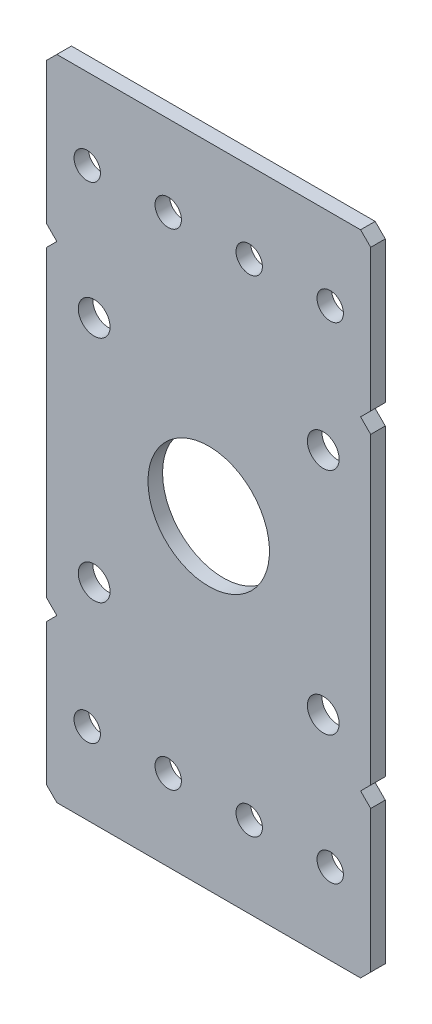
ISO-10303-21;
HEADER;
FILE_DESCRIPTION(('STEP AP214'),'2;1');
FILE_NAME('part.step','',(''),(''),'','','');
FILE_SCHEMA(('AUTOMOTIVE_DESIGN { 1 0 10303 214 1 1 1 1 }'));
ENDSEC;
DATA;
#1=APPLICATION_CONTEXT('core data for automotive mechanical design processes');
#2=APPLICATION_PROTOCOL_DEFINITION('international standard','automotive_design',2000,#1);
#3=PRODUCT_CONTEXT('',#1,'mechanical');
#4=PRODUCT('Part','Part','',(#3));
#5=PRODUCT_RELATED_PRODUCT_CATEGORY('part','',(#4));
#6=PRODUCT_DEFINITION_FORMATION('','',#4);
#7=PRODUCT_DEFINITION_CONTEXT('part definition',#1,'design');
#8=PRODUCT_DEFINITION('design','',#6,#7);
#9=PRODUCT_DEFINITION_SHAPE('','',#8);
#10=(LENGTH_UNIT() NAMED_UNIT(*) SI_UNIT(.MILLI.,.METRE.));
#11=(NAMED_UNIT(*) PLANE_ANGLE_UNIT() SI_UNIT($,.RADIAN.));
#12=(NAMED_UNIT(*) SI_UNIT($,.STERADIAN.) SOLID_ANGLE_UNIT());
#13=UNCERTAINTY_MEASURE_WITH_UNIT(LENGTH_MEASURE(1.E-05),#10,'distance_accuracy_value','');
#14=(GEOMETRIC_REPRESENTATION_CONTEXT(3) GLOBAL_UNCERTAINTY_ASSIGNED_CONTEXT((#13)) GLOBAL_UNIT_ASSIGNED_CONTEXT((#10,
#11,#12)) REPRESENTATION_CONTEXT('',''));
#15=CARTESIAN_POINT('',(0.,0.,0.));
#16=DIRECTION('',(0.,0.,1.));
#17=DIRECTION('',(1.,0.,0.));
#18=AXIS2_PLACEMENT_3D('',#15,#16,#17);
#19=CARTESIAN_POINT('',(25.4,50.8,2.286));
#20=DIRECTION('',(0.,0.,-1.));
#21=DIRECTION('',(-1.,0.,0.));
#22=AXIS2_PLACEMENT_3D('',#19,#20,#21);
#23=PLANE('',#22);
#24=CARTESIAN_POINT('',(-17.9605122421383,-17.9605122421383,2.286));
#25=DIRECTION('',(0.,0.,-1.));
#26=DIRECTION('',(-1.,0.,0.));
#27=AXIS2_PLACEMENT_3D('',#24,#25,#26);
#28=CIRCLE('',#27,2.4892);
#29=CARTESIAN_POINT('',(-20.4497122421383,-17.9605122421383,2.286));
#30=VERTEX_POINT('',#29);
#31=EDGE_CURVE('E213',#30,#30,#28,.T.);
#32=ORIENTED_EDGE('',*,*,#31,.T.);
#33=EDGE_LOOP('',(#32));
#34=FACE_BOUND('',#33,.T.);
#35=CARTESIAN_POINT('',(-19.05,-38.1,2.286));
#36=DIRECTION('',(0.,0.,-1.));
#37=DIRECTION('',(-1.,0.,0.));
#38=AXIS2_PLACEMENT_3D('',#35,#36,#37);
#39=CIRCLE('',#38,2.0701);
#40=CARTESIAN_POINT('',(-21.1201,-38.1,2.286));
#41=VERTEX_POINT('',#40);
#42=EDGE_CURVE('E217',#41,#41,#39,.T.);
#43=ORIENTED_EDGE('',*,*,#42,.T.);
#44=EDGE_LOOP('',(#43));
#45=FACE_BOUND('',#44,.T.);
#46=CARTESIAN_POINT('',(-6.35000000000001,-38.1,2.286));
#47=DIRECTION('',(0.,0.,-1.));
#48=DIRECTION('',(-1.,0.,0.));
#49=AXIS2_PLACEMENT_3D('',#46,#47,#48);
#50=CIRCLE('',#49,2.07009999999999);
#51=CARTESIAN_POINT('',(-8.4201,-38.1,2.286));
#52=VERTEX_POINT('',#51);
#53=EDGE_CURVE('E220',#52,#52,#50,.T.);
#54=ORIENTED_EDGE('',*,*,#53,.T.);
#55=EDGE_LOOP('',(#54));
#56=FACE_BOUND('',#55,.T.);
#57=CARTESIAN_POINT('',(19.05,-38.1,2.286));
#58=DIRECTION('',(0.,0.,-1.));
#59=DIRECTION('',(-1.,0.,0.));
#60=AXIS2_PLACEMENT_3D('',#57,#58,#59);
#61=CIRCLE('',#60,2.07009999999999);
#62=CARTESIAN_POINT('',(16.9799,-38.1,2.286));
#63=VERTEX_POINT('',#62);
#64=EDGE_CURVE('E223',#63,#63,#61,.T.);
#65=ORIENTED_EDGE('',*,*,#64,.T.);
#66=EDGE_LOOP('',(#65));
#67=FACE_BOUND('',#66,.T.);
#68=CARTESIAN_POINT('',(0.,0.,2.286));
#69=DIRECTION('',(0.,0.,-1.));
#70=DIRECTION('',(-1.,0.,0.));
#71=AXIS2_PLACEMENT_3D('',#68,#69,#70);
#72=CIRCLE('',#71,9.525);
#73=CARTESIAN_POINT('',(-9.525,0.,2.286));
#74=VERTEX_POINT('',#73);
#75=EDGE_CURVE('E226',#74,#74,#72,.T.);
#76=ORIENTED_EDGE('',*,*,#75,.T.);
#77=EDGE_LOOP('',(#76));
#78=FACE_BOUND('',#77,.T.);
#79=CARTESIAN_POINT('',(6.34999999999999,38.1,2.286));
#80=DIRECTION('',(0.,0.,-1.));
#81=DIRECTION('',(-1.,0.,0.));
#82=AXIS2_PLACEMENT_3D('',#79,#80,#81);
#83=CIRCLE('',#82,2.07009999999999);
#84=CARTESIAN_POINT('',(4.2799,38.1,2.286));
#85=VERTEX_POINT('',#84);
#86=EDGE_CURVE('E229',#85,#85,#83,.T.);
#87=ORIENTED_EDGE('',*,*,#86,.T.);
#88=EDGE_LOOP('',(#87));
#89=FACE_BOUND('',#88,.T.);
#90=CARTESIAN_POINT('',(-19.05,38.1,2.286));
#91=DIRECTION('',(0.,0.,-1.));
#92=DIRECTION('',(-1.,0.,0.));
#93=AXIS2_PLACEMENT_3D('',#90,#91,#92);
#94=CIRCLE('',#93,2.0701);
#95=CARTESIAN_POINT('',(-21.1201,38.1,2.286));
#96=VERTEX_POINT('',#95);
#97=EDGE_CURVE('E232',#96,#96,#94,.T.);
#98=ORIENTED_EDGE('',*,*,#97,.T.);
#99=EDGE_LOOP('',(#98));
#100=FACE_BOUND('',#99,.T.);
#101=DIRECTION('',(0.707106781186543,-0.707106781186552,0.));
#102=VECTOR('',#101,1.);
#103=CARTESIAN_POINT('',(23.8125,-25.4,2.286));
#104=LINE('',#103,#102);
#105=CARTESIAN_POINT('',(25.4,-26.9875,2.286));
#106=VERTEX_POINT('',#105);
#107=CARTESIAN_POINT('',(23.8125,-25.4,2.286));
#108=VERTEX_POINT('',#107);
#109=EDGE_CURVE('E154',#106,#108,#104,.F.);
#110=ORIENTED_EDGE('',*,*,#109,.T.);
#111=DIRECTION('',(-0.707106781186555,-0.707106781186541,0.));
#112=VECTOR('',#111,1.);
#113=CARTESIAN_POINT('',(25.4,-23.8125,2.286));
#114=LINE('',#113,#112);
#115=CARTESIAN_POINT('',(25.4,-23.8125,2.286));
#116=VERTEX_POINT('',#115);
#117=EDGE_CURVE('E251',#108,#116,#114,.F.);
#118=ORIENTED_EDGE('',*,*,#117,.T.);
#119=DIRECTION('',(0.,1.,0.));
#120=VECTOR('',#119,1.);
#121=CARTESIAN_POINT('',(25.4,25.4,2.286));
#122=LINE('',#121,#120);
#123=CARTESIAN_POINT('',(25.4,23.8125,2.286));
#124=VERTEX_POINT('',#123);
#125=EDGE_CURVE('E261',#116,#124,#122,.T.);
#126=ORIENTED_EDGE('',*,*,#125,.T.);
#127=DIRECTION('',(0.707106781186549,-0.707106781186546,0.));
#128=VECTOR('',#127,1.);
#129=CARTESIAN_POINT('',(23.8125,25.4,2.286));
#130=LINE('',#129,#128);
#131=CARTESIAN_POINT('',(23.8125,25.4,2.286));
#132=VERTEX_POINT('',#131);
#133=EDGE_CURVE('E265',#124,#132,#130,.F.);
#134=ORIENTED_EDGE('',*,*,#133,.T.);
#135=DIRECTION('',(-0.707106781186543,-0.707106781186552,0.));
#136=VECTOR('',#135,1.);
#137=CARTESIAN_POINT('',(25.4,26.9875,2.286));
#138=LINE('',#137,#136);
#139=CARTESIAN_POINT('',(25.4,26.9875,2.286));
#140=VERTEX_POINT('',#139);
#141=EDGE_CURVE('E270',#132,#140,#138,.F.);
#142=ORIENTED_EDGE('',*,*,#141,.T.);
#143=DIRECTION('',(0.,1.,0.));
#144=VECTOR('',#143,1.);
#145=CARTESIAN_POINT('',(25.4,25.4,2.286));
#146=LINE('',#145,#144);
#147=CARTESIAN_POINT('',(25.4,49.2125,2.286));
#148=VERTEX_POINT('',#147);
#149=EDGE_CURVE('E275',#140,#148,#146,.T.);
#150=ORIENTED_EDGE('',*,*,#149,.T.);
#151=DIRECTION('',(0.707106781186548,-0.707106781186547,0.));
#152=VECTOR('',#151,1.);
#153=CARTESIAN_POINT('',(23.8125,50.8,2.286));
#154=LINE('',#153,#152);
#155=CARTESIAN_POINT('',(23.8125,50.8,2.286));
#156=VERTEX_POINT('',#155);
#157=EDGE_CURVE('E280',#148,#156,#154,.F.);
#158=ORIENTED_EDGE('',*,*,#157,.T.);
#159=DIRECTION('',(1.,0.,0.));
#160=VECTOR('',#159,1.);
#161=CARTESIAN_POINT('',(-25.4,50.8,2.286));
#162=LINE('',#161,#160);
#163=CARTESIAN_POINT('',(-23.8125,50.8,2.286));
#164=VERTEX_POINT('',#163);
#165=EDGE_CURVE('E287',#156,#164,#162,.F.);
#166=ORIENTED_EDGE('',*,*,#165,.T.);
#167=DIRECTION('',(0.707106781186548,0.707106781186548,0.));
#168=VECTOR('',#167,1.);
#169=CARTESIAN_POINT('',(-25.4,49.2125,2.286));
#170=LINE('',#169,#168);
#171=CARTESIAN_POINT('',(-25.4,49.2125,2.286));
#172=VERTEX_POINT('',#171);
#173=EDGE_CURVE('E289',#164,#172,#170,.F.);
#174=ORIENTED_EDGE('',*,*,#173,.T.);
#175=DIRECTION('',(0.,1.,0.));
#176=VECTOR('',#175,1.);
#177=CARTESIAN_POINT('',(-25.4,-25.4,2.286));
#178=LINE('',#177,#176);
#179=CARTESIAN_POINT('',(-25.4,26.9875,2.286));
#180=VERTEX_POINT('',#179);
#181=EDGE_CURVE('E296',#172,#180,#178,.F.);
#182=ORIENTED_EDGE('',*,*,#181,.T.);
#183=DIRECTION('',(-0.707106781186552,0.707106781186543,0.));
#184=VECTOR('',#183,1.);
#185=CARTESIAN_POINT('',(-25.4,26.9875,2.286));
#186=LINE('',#185,#184);
#187=CARTESIAN_POINT('',(-23.8125,25.4,2.286));
#188=VERTEX_POINT('',#187);
#189=EDGE_CURVE('E298',#180,#188,#186,.F.);
#190=ORIENTED_EDGE('',*,*,#189,.T.);
#191=DIRECTION('',(0.707106781186544,0.707106781186551,0.));
#192=VECTOR('',#191,1.);
#193=CARTESIAN_POINT('',(-23.8125,25.4,2.286));
#194=LINE('',#193,#192);
#195=CARTESIAN_POINT('',(-25.4,23.8125,2.286));
#196=VERTEX_POINT('',#195);
#197=EDGE_CURVE('E303',#188,#196,#194,.F.);
#198=ORIENTED_EDGE('',*,*,#197,.T.);
#199=DIRECTION('',(0.,1.,0.));
#200=VECTOR('',#199,1.);
#201=CARTESIAN_POINT('',(-25.4,-25.4,2.286));
#202=LINE('',#201,#200);
#203=CARTESIAN_POINT('',(-25.4,-23.8125,2.286));
#204=VERTEX_POINT('',#203);
#205=EDGE_CURVE('E310',#196,#204,#202,.F.);
#206=ORIENTED_EDGE('',*,*,#205,.T.);
#207=DIRECTION('',(-0.707106781186554,0.707106781186541,0.));
#208=VECTOR('',#207,1.);
#209=CARTESIAN_POINT('',(-25.4,-23.8125,2.286));
#210=LINE('',#209,#208);
#211=CARTESIAN_POINT('',(-23.8125,-25.4,2.286));
#212=VERTEX_POINT('',#211);
#213=EDGE_CURVE('E312',#204,#212,#210,.F.);
#214=ORIENTED_EDGE('',*,*,#213,.T.);
#215=DIRECTION('',(0.707106781186541,0.707106781186554,0.));
#216=VECTOR('',#215,1.);
#217=CARTESIAN_POINT('',(-23.8125,-25.4,2.286));
#218=LINE('',#217,#216);
#219=CARTESIAN_POINT('',(-25.4,-26.9875,2.286));
#220=VERTEX_POINT('',#219);
#221=EDGE_CURVE('E317',#212,#220,#218,.F.);
#222=ORIENTED_EDGE('',*,*,#221,.T.);
#223=DIRECTION('',(0.,1.,0.));
#224=VECTOR('',#223,1.);
#225=CARTESIAN_POINT('',(-25.4,-25.4,2.286));
#226=LINE('',#225,#224);
#227=CARTESIAN_POINT('',(-25.4,-49.2125,2.286));
#228=VERTEX_POINT('',#227);
#229=EDGE_CURVE('E322',#220,#228,#226,.F.);
#230=ORIENTED_EDGE('',*,*,#229,.T.);
#231=DIRECTION('',(-0.707106781186548,0.707106781186548,0.));
#232=VECTOR('',#231,1.);
#233=CARTESIAN_POINT('',(-23.8125,-50.8,2.286));
#234=LINE('',#233,#232);
#235=CARTESIAN_POINT('',(-23.8125,-50.8,2.286));
#236=VERTEX_POINT('',#235);
#237=EDGE_CURVE('E327',#228,#236,#234,.F.);
#238=ORIENTED_EDGE('',*,*,#237,.T.);
#239=DIRECTION('',(1.,0.,0.));
#240=VECTOR('',#239,1.);
#241=CARTESIAN_POINT('',(-25.4,-50.8,2.286));
#242=LINE('',#241,#240);
#243=CARTESIAN_POINT('',(23.8125,-50.8,2.286));
#244=VERTEX_POINT('',#243);
#245=EDGE_CURVE('E334',#236,#244,#242,.T.);
#246=ORIENTED_EDGE('',*,*,#245,.T.);
#247=DIRECTION('',(-0.707106781186548,-0.707106781186547,0.));
#248=VECTOR('',#247,1.);
#249=CARTESIAN_POINT('',(25.4,-49.2125,2.286));
#250=LINE('',#249,#248);
#251=CARTESIAN_POINT('',(25.4,-49.2125,2.286));
#252=VERTEX_POINT('',#251);
#253=EDGE_CURVE('E157',#244,#252,#250,.F.);
#254=ORIENTED_EDGE('',*,*,#253,.T.);
#255=DIRECTION('',(0.,1.,0.));
#256=VECTOR('',#255,1.);
#257=CARTESIAN_POINT('',(25.4,25.4,2.286));
#258=LINE('',#257,#256);
#259=EDGE_CURVE('E148',#252,#106,#258,.T.);
#260=ORIENTED_EDGE('',*,*,#259,.T.);
#261=EDGE_LOOP('',(#110,#118,#126,#134,#142,#150,#158,#166,#174,#182,#190,#198,#206,#214,#222,
#230,#238,#246,#254,#260));
#262=FACE_BOUND('',#261,.T.);
#263=CARTESIAN_POINT('',(-6.35000000000001,38.1,2.286));
#264=DIRECTION('',(0.,0.,-1.));
#265=DIRECTION('',(-1.,0.,0.));
#266=AXIS2_PLACEMENT_3D('',#263,#264,#265);
#267=CIRCLE('',#266,2.07009999999999);
#268=CARTESIAN_POINT('',(-8.4201,38.1,2.286));
#269=VERTEX_POINT('',#268);
#270=EDGE_CURVE('E235',#269,#269,#267,.T.);
#271=ORIENTED_EDGE('',*,*,#270,.T.);
#272=EDGE_LOOP('',(#271));
#273=FACE_BOUND('',#272,.T.);
#274=CARTESIAN_POINT('',(19.05,38.1,2.286));
#275=DIRECTION('',(0.,0.,-1.));
#276=DIRECTION('',(-1.,0.,0.));
#277=AXIS2_PLACEMENT_3D('',#274,#275,#276);
#278=CIRCLE('',#277,2.07009999999999);
#279=CARTESIAN_POINT('',(16.9799,38.1,2.286));
#280=VERTEX_POINT('',#279);
#281=EDGE_CURVE('E238',#280,#280,#278,.T.);
#282=ORIENTED_EDGE('',*,*,#281,.T.);
#283=EDGE_LOOP('',(#282));
#284=FACE_BOUND('',#283,.T.);
#285=CARTESIAN_POINT('',(-17.9605122421383,17.9605122421383,2.286));
#286=DIRECTION('',(0.,0.,-1.));
#287=DIRECTION('',(-1.,0.,0.));
#288=AXIS2_PLACEMENT_3D('',#285,#286,#287);
#289=CIRCLE('',#288,2.4892);
#290=CARTESIAN_POINT('',(-20.4497122421383,17.9605122421383,2.286));
#291=VERTEX_POINT('',#290);
#292=EDGE_CURVE('E241',#291,#291,#289,.T.);
#293=ORIENTED_EDGE('',*,*,#292,.T.);
#294=EDGE_LOOP('',(#293));
#295=FACE_BOUND('',#294,.T.);
#296=CARTESIAN_POINT('',(6.34999999999999,-38.1,2.286));
#297=DIRECTION('',(0.,0.,-1.));
#298=DIRECTION('',(-1.,0.,0.));
#299=AXIS2_PLACEMENT_3D('',#296,#297,#298);
#300=CIRCLE('',#299,2.07009999999999);
#301=CARTESIAN_POINT('',(4.2799,-38.1,2.286));
#302=VERTEX_POINT('',#301);
#303=EDGE_CURVE('E244',#302,#302,#300,.T.);
#304=ORIENTED_EDGE('',*,*,#303,.T.);
#305=EDGE_LOOP('',(#304));
#306=FACE_BOUND('',#305,.T.);
#307=CARTESIAN_POINT('',(17.9605122421383,-17.9605122421383,2.286));
#308=DIRECTION('',(0.,0.,-1.));
#309=DIRECTION('',(-1.,0.,0.));
#310=AXIS2_PLACEMENT_3D('',#307,#308,#309);
#311=CIRCLE('',#310,2.4892);
#312=CARTESIAN_POINT('',(15.4713122421383,-17.9605122421383,2.286));
#313=VERTEX_POINT('',#312);
#314=EDGE_CURVE('E246',#313,#313,#311,.T.);
#315=ORIENTED_EDGE('',*,*,#314,.T.);
#316=EDGE_LOOP('',(#315));
#317=FACE_BOUND('',#316,.T.);
#318=CARTESIAN_POINT('',(17.9605122421383,17.9605122421383,2.286));
#319=DIRECTION('',(0.,0.,-1.));
#320=DIRECTION('',(-1.,0.,0.));
#321=AXIS2_PLACEMENT_3D('',#318,#319,#320);
#322=CIRCLE('',#321,2.4892);
#323=CARTESIAN_POINT('',(15.4713122421383,17.9605122421383,2.286));
#324=VERTEX_POINT('',#323);
#325=EDGE_CURVE('E17',#324,#324,#322,.T.);
#326=ORIENTED_EDGE('',*,*,#325,.T.);
#327=EDGE_LOOP('',(#326));
#328=FACE_BOUND('',#327,.T.);
#329=ADVANCED_FACE('F14',(#34,#45,#56,#67,#78,#89,#100,#262,#273,#284,#295,#306,#317,#328),#23,.F.);
#330=CARTESIAN_POINT('',(23.8125,-25.4,0.));
#331=DIRECTION('',(-0.707106781186552,-0.707106781186543,0.));
#332=DIRECTION('',(0.707106781186543,-0.707106781186552,0.));
#333=AXIS2_PLACEMENT_3D('',#330,#331,#332);
#334=PLANE('',#333);
#335=DIRECTION('',(0.,0.,1.));
#336=VECTOR('',#335,1.);
#337=CARTESIAN_POINT('',(25.4,-26.9875,2.286));
#338=LINE('',#337,#336);
#339=CARTESIAN_POINT('',(25.4,-26.9875,0.));
#340=VERTEX_POINT('',#339);
#341=EDGE_CURVE('E159',#106,#340,#338,.F.);
#342=ORIENTED_EDGE('',*,*,#341,.T.);
#343=DIRECTION('',(0.70710678118654,-0.707106781186555,0.));
#344=VECTOR('',#343,1.);
#345=CARTESIAN_POINT('',(23.8125,-25.4,0.));
#346=LINE('',#345,#344);
#347=CARTESIAN_POINT('',(23.8125,-25.4,0.));
#348=VERTEX_POINT('',#347);
#349=EDGE_CURVE('E216',#348,#340,#346,.T.);
#350=ORIENTED_EDGE('',*,*,#349,.F.);
#351=DIRECTION('',(0.,0.,1.));
#352=VECTOR('',#351,1.);
#353=CARTESIAN_POINT('',(23.8125,-25.4,0.));
#354=LINE('',#353,#352);
#355=EDGE_CURVE('E165',#348,#108,#354,.T.);
#356=ORIENTED_EDGE('',*,*,#355,.T.);
#357=ORIENTED_EDGE('',*,*,#109,.F.);
#358=EDGE_LOOP('',(#342,#350,#356,#357));
#359=FACE_BOUND('',#358,.T.);
#360=ADVANCED_FACE('F162',(#359),#334,.F.);
#361=CARTESIAN_POINT('',(25.4,25.4,2.286));
#362=DIRECTION('',(-1.,0.,0.));
#363=DIRECTION('',(0.,0.,1.));
#364=AXIS2_PLACEMENT_3D('',#361,#362,#363);
#365=PLANE('',#364);
#366=ORIENTED_EDGE('',*,*,#341,.F.);
#367=ORIENTED_EDGE('',*,*,#259,.F.);
#368=DIRECTION('',(0.,0.,1.));
#369=VECTOR('',#368,1.);
#370=CARTESIAN_POINT('',(25.4,-49.2125,2.286));
#371=LINE('',#370,#369);
#372=CARTESIAN_POINT('',(25.4,-49.2125,0.));
#373=VERTEX_POINT('',#372);
#374=EDGE_CURVE('E172',#252,#373,#371,.F.);
#375=ORIENTED_EDGE('',*,*,#374,.T.);
#376=DIRECTION('',(0.,1.,0.));
#377=VECTOR('',#376,1.);
#378=CARTESIAN_POINT('',(25.4,50.8,0.));
#379=LINE('',#378,#377);
#380=EDGE_CURVE('E170',#340,#373,#379,.F.);
#381=ORIENTED_EDGE('',*,*,#380,.F.);
#382=EDGE_LOOP('',(#366,#367,#375,#381));
#383=FACE_BOUND('',#382,.T.);
#384=ADVANCED_FACE('F168',(#383),#365,.F.);
#385=CARTESIAN_POINT('',(25.4,-49.2125,2.286));
#386=DIRECTION('',(-0.707106781186547,0.707106781186548,0.));
#387=DIRECTION('',(-0.707106781186548,-0.707106781186547,0.));
#388=AXIS2_PLACEMENT_3D('',#385,#386,#387);
#389=PLANE('',#388);
#390=DIRECTION('',(0.,0.,1.));
#391=VECTOR('',#390,1.);
#392=CARTESIAN_POINT('',(23.8125,-50.8,2.286));
#393=LINE('',#392,#391);
#394=CARTESIAN_POINT('',(23.8125,-50.8,0.));
#395=VERTEX_POINT('',#394);
#396=EDGE_CURVE('E332',#244,#395,#393,.F.);
#397=ORIENTED_EDGE('',*,*,#396,.T.);
#398=DIRECTION('',(-0.707106781186548,-0.707106781186547,0.));
#399=VECTOR('',#398,1.);
#400=CARTESIAN_POINT('',(25.4,-49.2125,0.));
#401=LINE('',#400,#399);
#402=EDGE_CURVE('E350',#373,#395,#401,.T.);
#403=ORIENTED_EDGE('',*,*,#402,.F.);
#404=ORIENTED_EDGE('',*,*,#374,.F.);
#405=ORIENTED_EDGE('',*,*,#253,.F.);
#406=EDGE_LOOP('',(#397,#403,#404,#405));
#407=FACE_BOUND('',#406,.T.);
#408=ADVANCED_FACE('F339',(#407),#389,.F.);
#409=CARTESIAN_POINT('',(-25.4,-50.8,2.286));
#410=DIRECTION('',(0.,1.,0.));
#411=DIRECTION('',(0.,0.,1.));
#412=AXIS2_PLACEMENT_3D('',#409,#410,#411);
#413=PLANE('',#412);
#414=ORIENTED_EDGE('',*,*,#396,.F.);
#415=ORIENTED_EDGE('',*,*,#245,.F.);
#416=DIRECTION('',(0.,0.,1.));
#417=VECTOR('',#416,1.);
#418=CARTESIAN_POINT('',(-23.8125,-50.8,2.286));
#419=LINE('',#418,#417);
#420=CARTESIAN_POINT('',(-23.8125,-50.8,0.));
#421=VERTEX_POINT('',#420);
#422=EDGE_CURVE('E330',#236,#421,#419,.F.);
#423=ORIENTED_EDGE('',*,*,#422,.T.);
#424=DIRECTION('',(-1.,0.,0.));
#425=VECTOR('',#424,1.);
#426=CARTESIAN_POINT('',(25.4,-50.8,0.));
#427=LINE('',#426,#425);
#428=EDGE_CURVE('E344',#395,#421,#427,.T.);
#429=ORIENTED_EDGE('',*,*,#428,.F.);
#430=EDGE_LOOP('',(#414,#415,#423,#429));
#431=FACE_BOUND('',#430,.T.);
#432=ADVANCED_FACE('F342',(#431),#413,.F.);
#433=CARTESIAN_POINT('',(-23.8125,-50.8,2.286));
#434=DIRECTION('',(0.707106781186548,0.707106781186548,0.));
#435=DIRECTION('',(-0.707106781186548,0.707106781186548,0.));
#436=AXIS2_PLACEMENT_3D('',#433,#434,#435);
#437=PLANE('',#436);
#438=DIRECTION('',(0.,0.,-1.));
#439=VECTOR('',#438,1.);
#440=CARTESIAN_POINT('',(-25.4,-49.2125,2.286));
#441=LINE('',#440,#439);
#442=CARTESIAN_POINT('',(-25.4,-49.2125,0.));
#443=VERTEX_POINT('',#442);
#444=EDGE_CURVE('E325',#228,#443,#441,.T.);
#445=ORIENTED_EDGE('',*,*,#444,.T.);
#446=DIRECTION('',(-0.707106781186551,0.707106781186544,0.));
#447=VECTOR('',#446,1.);
#448=CARTESIAN_POINT('',(-23.8125,-50.8,0.));
#449=LINE('',#448,#447);
#450=EDGE_CURVE('E349',#421,#443,#449,.T.);
#451=ORIENTED_EDGE('',*,*,#450,.F.);
#452=ORIENTED_EDGE('',*,*,#422,.F.);
#453=ORIENTED_EDGE('',*,*,#237,.F.);
#454=EDGE_LOOP('',(#445,#451,#452,#453));
#455=FACE_BOUND('',#454,.T.);
#456=ADVANCED_FACE('F686',(#455),#437,.F.);
#457=CARTESIAN_POINT('',(-25.4,-25.4,2.286));
#458=DIRECTION('',(1.,0.,0.));
#459=DIRECTION('',(0.,0.,-1.));
#460=AXIS2_PLACEMENT_3D('',#457,#458,#459);
#461=PLANE('',#460);
#462=DIRECTION('',(0.,0.,1.));
#463=VECTOR('',#462,1.);
#464=CARTESIAN_POINT('',(-25.4,-26.9875,0.));
#465=LINE('',#464,#463);
#466=CARTESIAN_POINT('',(-25.4,-26.9875,0.));
#467=VERTEX_POINT('',#466);
#468=EDGE_CURVE('E320',#220,#467,#465,.F.);
#469=ORIENTED_EDGE('',*,*,#468,.T.);
#470=DIRECTION('',(0.,1.,0.));
#471=VECTOR('',#470,1.);
#472=CARTESIAN_POINT('',(-25.4,50.8,0.));
#473=LINE('',#472,#471);
#474=EDGE_CURVE('E357',#443,#467,#473,.T.);
#475=ORIENTED_EDGE('',*,*,#474,.F.);
#476=ORIENTED_EDGE('',*,*,#444,.F.);
#477=ORIENTED_EDGE('',*,*,#229,.F.);
#478=EDGE_LOOP('',(#469,#475,#476,#477));
#479=FACE_BOUND('',#478,.T.);
#480=ADVANCED_FACE('F677',(#479),#461,.F.);
#481=CARTESIAN_POINT('',(-23.8125,-25.4,0.));
#482=DIRECTION('',(0.707106781186554,-0.707106781186541,0.));
#483=DIRECTION('',(0.707106781186541,0.707106781186554,0.));
#484=AXIS2_PLACEMENT_3D('',#481,#482,#483);
#485=PLANE('',#484);
#486=DIRECTION('',(0.,0.,1.));
#487=VECTOR('',#486,1.);
#488=CARTESIAN_POINT('',(-23.8125,-25.4,0.));
#489=LINE('',#488,#487);
#490=CARTESIAN_POINT('',(-23.8125,-25.4,0.));
#491=VERTEX_POINT('',#490);
#492=EDGE_CURVE('E315',#212,#491,#489,.F.);
#493=ORIENTED_EDGE('',*,*,#492,.T.);
#494=DIRECTION('',(0.707106781186538,0.707106781186557,0.));
#495=VECTOR('',#494,1.);
#496=CARTESIAN_POINT('',(-25.4,-26.9875,0.));
#497=LINE('',#496,#495);
#498=EDGE_CURVE('E360',#467,#491,#497,.T.);
#499=ORIENTED_EDGE('',*,*,#498,.F.);
#500=ORIENTED_EDGE('',*,*,#468,.F.);
#501=ORIENTED_EDGE('',*,*,#221,.F.);
#502=EDGE_LOOP('',(#493,#499,#500,#501));
#503=FACE_BOUND('',#502,.T.);
#504=ADVANCED_FACE('F668',(#503),#485,.F.);
#505=CARTESIAN_POINT('',(-25.4,-23.8125,0.));
#506=DIRECTION('',(0.707106781186541,0.707106781186554,0.));
#507=DIRECTION('',(-0.707106781186554,0.707106781186541,0.));
#508=AXIS2_PLACEMENT_3D('',#505,#506,#507);
#509=PLANE('',#508);
#510=DIRECTION('',(0.,0.,-1.));
#511=VECTOR('',#510,1.);
#512=CARTESIAN_POINT('',(-25.4,-23.8125,2.286));
#513=LINE('',#512,#511);
#514=CARTESIAN_POINT('',(-25.4,-23.8125,0.));
#515=VERTEX_POINT('',#514);
#516=EDGE_CURVE('E308',#204,#515,#513,.T.);
#517=ORIENTED_EDGE('',*,*,#516,.T.);
#518=DIRECTION('',(-0.707106781186554,0.707106781186541,0.));
#519=VECTOR('',#518,1.);
#520=CARTESIAN_POINT('',(-23.8125,-25.4,0.));
#521=LINE('',#520,#519);
#522=EDGE_CURVE('E363',#491,#515,#521,.T.);
#523=ORIENTED_EDGE('',*,*,#522,.F.);
#524=ORIENTED_EDGE('',*,*,#492,.F.);
#525=ORIENTED_EDGE('',*,*,#213,.F.);
#526=EDGE_LOOP('',(#517,#523,#524,#525));
#527=FACE_BOUND('',#526,.T.);
#528=ADVANCED_FACE('F659',(#527),#509,.F.);
#529=CARTESIAN_POINT('',(-25.4,-25.4,2.286));
#530=DIRECTION('',(1.,0.,0.));
#531=DIRECTION('',(0.,0.,-1.));
#532=AXIS2_PLACEMENT_3D('',#529,#530,#531);
#533=PLANE('',#532);
#534=ORIENTED_EDGE('',*,*,#516,.F.);
#535=ORIENTED_EDGE('',*,*,#205,.F.);
#536=DIRECTION('',(0.,0.,1.));
#537=VECTOR('',#536,1.);
#538=CARTESIAN_POINT('',(-25.4,23.8125,0.));
#539=LINE('',#538,#537);
#540=CARTESIAN_POINT('',(-25.4,23.8125,0.));
#541=VERTEX_POINT('',#540);
#542=EDGE_CURVE('E306',#196,#541,#539,.F.);
#543=ORIENTED_EDGE('',*,*,#542,.T.);
#544=DIRECTION('',(0.,1.,0.));
#545=VECTOR('',#544,1.);
#546=CARTESIAN_POINT('',(-25.4,50.8,0.));
#547=LINE('',#546,#545);
#548=EDGE_CURVE('E366',#515,#541,#547,.T.);
#549=ORIENTED_EDGE('',*,*,#548,.F.);
#550=EDGE_LOOP('',(#534,#535,#543,#549));
#551=FACE_BOUND('',#550,.T.);
#552=ADVANCED_FACE('F650',(#551),#533,.F.);
#553=CARTESIAN_POINT('',(-23.8125,25.4,0.));
#554=DIRECTION('',(0.707106781186551,-0.707106781186544,0.));
#555=DIRECTION('',(0.707106781186544,0.707106781186551,0.));
#556=AXIS2_PLACEMENT_3D('',#553,#554,#555);
#557=PLANE('',#556);
#558=DIRECTION('',(0.,0.,1.));
#559=VECTOR('',#558,1.);
#560=CARTESIAN_POINT('',(-23.8125,25.4,0.));
#561=LINE('',#560,#559);
#562=CARTESIAN_POINT('',(-23.8125,25.4,0.));
#563=VERTEX_POINT('',#562);
#564=EDGE_CURVE('E301',#188,#563,#561,.F.);
#565=ORIENTED_EDGE('',*,*,#564,.T.);
#566=DIRECTION('',(0.707106781186541,0.707106781186554,0.));
#567=VECTOR('',#566,1.);
#568=CARTESIAN_POINT('',(-25.4,23.8125,0.));
#569=LINE('',#568,#567);
#570=EDGE_CURVE('E369',#541,#563,#569,.T.);
#571=ORIENTED_EDGE('',*,*,#570,.F.);
#572=ORIENTED_EDGE('',*,*,#542,.F.);
#573=ORIENTED_EDGE('',*,*,#197,.F.);
#574=EDGE_LOOP('',(#565,#571,#572,#573));
#575=FACE_BOUND('',#574,.T.);
#576=ADVANCED_FACE('F641',(#575),#557,.F.);
#577=CARTESIAN_POINT('',(-25.4,26.9875,0.));
#578=DIRECTION('',(0.707106781186543,0.707106781186552,0.));
#579=DIRECTION('',(-0.707106781186552,0.707106781186543,0.));
#580=AXIS2_PLACEMENT_3D('',#577,#578,#579);
#581=PLANE('',#580);
#582=DIRECTION('',(0.,0.,-1.));
#583=VECTOR('',#582,1.);
#584=CARTESIAN_POINT('',(-25.4,26.9875,2.286));
#585=LINE('',#584,#583);
#586=CARTESIAN_POINT('',(-25.4,26.9875,0.));
#587=VERTEX_POINT('',#586);
#588=EDGE_CURVE('E294',#180,#587,#585,.T.);
#589=ORIENTED_EDGE('',*,*,#588,.T.);
#590=DIRECTION('',(-0.707106781186551,0.707106781186544,0.));
#591=VECTOR('',#590,1.);
#592=CARTESIAN_POINT('',(-23.8125,25.4,0.));
#593=LINE('',#592,#591);
#594=EDGE_CURVE('E372',#563,#587,#593,.T.);
#595=ORIENTED_EDGE('',*,*,#594,.F.);
#596=ORIENTED_EDGE('',*,*,#564,.F.);
#597=ORIENTED_EDGE('',*,*,#189,.F.);
#598=EDGE_LOOP('',(#589,#595,#596,#597));
#599=FACE_BOUND('',#598,.T.);
#600=ADVANCED_FACE('F632',(#599),#581,.F.);
#601=CARTESIAN_POINT('',(-25.4,-25.4,2.286));
#602=DIRECTION('',(1.,0.,0.));
#603=DIRECTION('',(0.,0.,-1.));
#604=AXIS2_PLACEMENT_3D('',#601,#602,#603);
#605=PLANE('',#604);
#606=ORIENTED_EDGE('',*,*,#588,.F.);
#607=ORIENTED_EDGE('',*,*,#181,.F.);
#608=DIRECTION('',(0.,0.,1.));
#609=VECTOR('',#608,1.);
#610=CARTESIAN_POINT('',(-25.4,49.2125,2.286));
#611=LINE('',#610,#609);
#612=CARTESIAN_POINT('',(-25.4,49.2125,0.));
#613=VERTEX_POINT('',#612);
#614=EDGE_CURVE('E292',#172,#613,#611,.F.);
#615=ORIENTED_EDGE('',*,*,#614,.T.);
#616=DIRECTION('',(0.,1.,0.));
#617=VECTOR('',#616,1.);
#618=CARTESIAN_POINT('',(-25.4,50.8,0.));
#619=LINE('',#618,#617);
#620=EDGE_CURVE('E375',#587,#613,#619,.T.);
#621=ORIENTED_EDGE('',*,*,#620,.F.);
#622=EDGE_LOOP('',(#606,#607,#615,#621));
#623=FACE_BOUND('',#622,.T.);
#624=ADVANCED_FACE('F623',(#623),#605,.F.);
#625=CARTESIAN_POINT('',(-25.4,49.2125,2.286));
#626=DIRECTION('',(0.707106781186548,-0.707106781186548,0.));
#627=DIRECTION('',(0.707106781186548,0.707106781186548,0.));
#628=AXIS2_PLACEMENT_3D('',#625,#626,#627);
#629=PLANE('',#628);
#630=DIRECTION('',(0.,0.,-1.));
#631=VECTOR('',#630,1.);
#632=CARTESIAN_POINT('',(-23.8125,50.8,2.286));
#633=LINE('',#632,#631);
#634=CARTESIAN_POINT('',(-23.8125,50.8,0.));
#635=VERTEX_POINT('',#634);
#636=EDGE_CURVE('E285',#164,#635,#633,.T.);
#637=ORIENTED_EDGE('',*,*,#636,.T.);
#638=DIRECTION('',(0.707106781186541,0.707106781186554,0.));
#639=VECTOR('',#638,1.);
#640=CARTESIAN_POINT('',(-25.4,49.2125,0.));
#641=LINE('',#640,#639);
#642=EDGE_CURVE('E378',#613,#635,#641,.T.);
#643=ORIENTED_EDGE('',*,*,#642,.F.);
#644=ORIENTED_EDGE('',*,*,#614,.F.);
#645=ORIENTED_EDGE('',*,*,#173,.F.);
#646=EDGE_LOOP('',(#637,#643,#644,#645));
#647=FACE_BOUND('',#646,.T.);
#648=ADVANCED_FACE('F614',(#647),#629,.F.);
#649=CARTESIAN_POINT('',(-25.4,50.8,2.286));
#650=DIRECTION('',(0.,-1.,0.));
#651=DIRECTION('',(0.,0.,-1.));
#652=AXIS2_PLACEMENT_3D('',#649,#650,#651);
#653=PLANE('',#652);
#654=ORIENTED_EDGE('',*,*,#636,.F.);
#655=ORIENTED_EDGE('',*,*,#165,.F.);
#656=DIRECTION('',(0.,0.,1.));
#657=VECTOR('',#656,1.);
#658=CARTESIAN_POINT('',(23.8125,50.8,2.286));
#659=LINE('',#658,#657);
#660=CARTESIAN_POINT('',(23.8125,50.8,0.));
#661=VERTEX_POINT('',#660);
#662=EDGE_CURVE('E283',#156,#661,#659,.F.);
#663=ORIENTED_EDGE('',*,*,#662,.T.);
#664=DIRECTION('',(-1.,0.,0.));
#665=VECTOR('',#664,1.);
#666=CARTESIAN_POINT('',(25.4,50.8,0.));
#667=LINE('',#666,#665);
#668=EDGE_CURVE('E381',#635,#661,#667,.F.);
#669=ORIENTED_EDGE('',*,*,#668,.F.);
#670=EDGE_LOOP('',(#654,#655,#663,#669));
#671=FACE_BOUND('',#670,.T.);
#672=ADVANCED_FACE('F605',(#671),#653,.F.);
#673=CARTESIAN_POINT('',(23.8125,50.8,2.286));
#674=DIRECTION('',(-0.707106781186547,-0.707106781186548,0.));
#675=DIRECTION('',(0.707106781186548,-0.707106781186547,0.));
#676=AXIS2_PLACEMENT_3D('',#673,#674,#675);
#677=PLANE('',#676);
#678=DIRECTION('',(0.,0.,1.));
#679=VECTOR('',#678,1.);
#680=CARTESIAN_POINT('',(25.4,49.2125,2.286));
#681=LINE('',#680,#679);
#682=CARTESIAN_POINT('',(25.4,49.2125,0.));
#683=VERTEX_POINT('',#682);
#684=EDGE_CURVE('E278',#148,#683,#681,.F.);
#685=ORIENTED_EDGE('',*,*,#684,.T.);
#686=DIRECTION('',(0.707106781186551,-0.707106781186544,0.));
#687=VECTOR('',#686,1.);
#688=CARTESIAN_POINT('',(23.8125,50.8,0.));
#689=LINE('',#688,#687);
#690=EDGE_CURVE('E384',#661,#683,#689,.T.);
#691=ORIENTED_EDGE('',*,*,#690,.F.);
#692=ORIENTED_EDGE('',*,*,#662,.F.);
#693=ORIENTED_EDGE('',*,*,#157,.F.);
#694=EDGE_LOOP('',(#685,#691,#692,#693));
#695=FACE_BOUND('',#694,.T.);
#696=ADVANCED_FACE('F596',(#695),#677,.F.);
#697=CARTESIAN_POINT('',(25.4,25.4,2.286));
#698=DIRECTION('',(-1.,0.,0.));
#699=DIRECTION('',(0.,0.,1.));
#700=AXIS2_PLACEMENT_3D('',#697,#698,#699);
#701=PLANE('',#700);
#702=DIRECTION('',(0.,0.,1.));
#703=VECTOR('',#702,1.);
#704=CARTESIAN_POINT('',(25.4,26.9875,0.));
#705=LINE('',#704,#703);
#706=CARTESIAN_POINT('',(25.4,26.9875,0.));
#707=VERTEX_POINT('',#706);
#708=EDGE_CURVE('E273',#140,#707,#705,.F.);
#709=ORIENTED_EDGE('',*,*,#708,.T.);
#710=DIRECTION('',(0.,1.,0.));
#711=VECTOR('',#710,1.);
#712=CARTESIAN_POINT('',(25.4,50.8,0.));
#713=LINE('',#712,#711);
#714=EDGE_CURVE('E387',#683,#707,#713,.F.);
#715=ORIENTED_EDGE('',*,*,#714,.F.);
#716=ORIENTED_EDGE('',*,*,#684,.F.);
#717=ORIENTED_EDGE('',*,*,#149,.F.);
#718=EDGE_LOOP('',(#709,#715,#716,#717));
#719=FACE_BOUND('',#718,.T.);
#720=ADVANCED_FACE('F587',(#719),#701,.F.);
#721=CARTESIAN_POINT('',(25.4,26.9875,0.));
#722=DIRECTION('',(-0.707106781186552,0.707106781186543,0.));
#723=DIRECTION('',(-0.707106781186543,-0.707106781186552,0.));
#724=AXIS2_PLACEMENT_3D('',#721,#722,#723);
#725=PLANE('',#724);
#726=DIRECTION('',(0.,0.,1.));
#727=VECTOR('',#726,1.);
#728=CARTESIAN_POINT('',(23.8125,25.4,0.));
#729=LINE('',#728,#727);
#730=CARTESIAN_POINT('',(23.8125,25.4,0.));
#731=VERTEX_POINT('',#730);
#732=EDGE_CURVE('E268',#132,#731,#729,.F.);
#733=ORIENTED_EDGE('',*,*,#732,.T.);
#734=DIRECTION('',(-0.707106781186544,-0.707106781186551,0.));
#735=VECTOR('',#734,1.);
#736=CARTESIAN_POINT('',(25.4,26.9875,0.));
#737=LINE('',#736,#735);
#738=EDGE_CURVE('E390',#707,#731,#737,.T.);
#739=ORIENTED_EDGE('',*,*,#738,.F.);
#740=ORIENTED_EDGE('',*,*,#708,.F.);
#741=ORIENTED_EDGE('',*,*,#141,.F.);
#742=EDGE_LOOP('',(#733,#739,#740,#741));
#743=FACE_BOUND('',#742,.T.);
#744=ADVANCED_FACE('F578',(#743),#725,.F.);
#745=CARTESIAN_POINT('',(23.8125,25.4,0.));
#746=DIRECTION('',(-0.707106781186546,-0.707106781186549,0.));
#747=DIRECTION('',(0.707106781186549,-0.707106781186546,0.));
#748=AXIS2_PLACEMENT_3D('',#745,#746,#747);
#749=PLANE('',#748);
#750=DIRECTION('',(0.,0.,1.));
#751=VECTOR('',#750,1.);
#752=CARTESIAN_POINT('',(25.4,23.8125,2.286));
#753=LINE('',#752,#751);
#754=CARTESIAN_POINT('',(25.4,23.8125,0.));
#755=VERTEX_POINT('',#754);
#756=EDGE_CURVE('E263',#124,#755,#753,.F.);
#757=ORIENTED_EDGE('',*,*,#756,.T.);
#758=DIRECTION('',(0.707106781186549,-0.707106781186546,0.));
#759=VECTOR('',#758,1.);
#760=CARTESIAN_POINT('',(23.8125,25.4,0.));
#761=LINE('',#760,#759);
#762=EDGE_CURVE('E393',#731,#755,#761,.T.);
#763=ORIENTED_EDGE('',*,*,#762,.F.);
#764=ORIENTED_EDGE('',*,*,#732,.F.);
#765=ORIENTED_EDGE('',*,*,#133,.F.);
#766=EDGE_LOOP('',(#757,#763,#764,#765));
#767=FACE_BOUND('',#766,.T.);
#768=ADVANCED_FACE('F413',(#767),#749,.F.);
#769=CARTESIAN_POINT('',(25.4,25.4,2.286));
#770=DIRECTION('',(-1.,0.,0.));
#771=DIRECTION('',(0.,0.,1.));
#772=AXIS2_PLACEMENT_3D('',#769,#770,#771);
#773=PLANE('',#772);
#774=DIRECTION('',(0.,0.,1.));
#775=VECTOR('',#774,1.);
#776=CARTESIAN_POINT('',(25.4,-23.8125,0.));
#777=LINE('',#776,#775);
#778=CARTESIAN_POINT('',(25.4,-23.8125,0.));
#779=VERTEX_POINT('',#778);
#780=EDGE_CURVE('E32',#116,#779,#777,.F.);
#781=ORIENTED_EDGE('',*,*,#780,.T.);
#782=DIRECTION('',(0.,1.,0.));
#783=VECTOR('',#782,1.);
#784=CARTESIAN_POINT('',(25.4,50.8,0.));
#785=LINE('',#784,#783);
#786=EDGE_CURVE('E396',#755,#779,#785,.F.);
#787=ORIENTED_EDGE('',*,*,#786,.F.);
#788=ORIENTED_EDGE('',*,*,#756,.F.);
#789=ORIENTED_EDGE('',*,*,#125,.F.);
#790=EDGE_LOOP('',(#781,#787,#788,#789));
#791=FACE_BOUND('',#790,.T.);
#792=ADVANCED_FACE('F403',(#791),#773,.F.);
#793=CARTESIAN_POINT('',(25.4,-23.8125,0.));
#794=DIRECTION('',(-0.707106781186541,0.707106781186555,0.));
#795=DIRECTION('',(-0.707106781186555,-0.707106781186541,0.));
#796=AXIS2_PLACEMENT_3D('',#793,#794,#795);
#797=PLANE('',#796);
#798=ORIENTED_EDGE('',*,*,#355,.F.);
#799=DIRECTION('',(-0.707106781186555,-0.70710678118654,0.));
#800=VECTOR('',#799,1.);
#801=CARTESIAN_POINT('',(25.4,-23.8125,0.));
#802=LINE('',#801,#800);
#803=EDGE_CURVE('E212',#779,#348,#802,.T.);
#804=ORIENTED_EDGE('',*,*,#803,.F.);
#805=ORIENTED_EDGE('',*,*,#780,.F.);
#806=ORIENTED_EDGE('',*,*,#117,.F.);
#807=EDGE_LOOP('',(#798,#804,#805,#806));
#808=FACE_BOUND('',#807,.T.);
#809=ADVANCED_FACE('F400',(#808),#797,.F.);
#810=CARTESIAN_POINT('',(17.9605122421383,17.9605122421383,2.286));
#811=DIRECTION('',(0.,0.,-1.));
#812=DIRECTION('',(-1.,0.,0.));
#813=AXIS2_PLACEMENT_3D('',#810,#811,#812);
#814=CYLINDRICAL_SURFACE('',#813,2.4892);
#815=ORIENTED_EDGE('',*,*,#325,.F.);
#816=EDGE_LOOP('',(#815));
#817=FACE_BOUND('',#816,.T.);
#818=CARTESIAN_POINT('',(17.9605122421383,17.9605122421383,0.));
#819=DIRECTION('',(0.,0.,-1.));
#820=DIRECTION('',(-1.,0.,0.));
#821=AXIS2_PLACEMENT_3D('',#818,#819,#820);
#822=CIRCLE('',#821,2.4892);
#823=CARTESIAN_POINT('',(15.4713122421383,17.9605122421383,0.));
#824=VERTEX_POINT('',#823);
#825=EDGE_CURVE('E209',#824,#824,#822,.F.);
#826=ORIENTED_EDGE('',*,*,#825,.F.);
#827=EDGE_LOOP('',(#826));
#828=FACE_BOUND('',#827,.T.);
#829=ADVANCED_FACE('F402',(#817,#828),#814,.F.);
#830=CARTESIAN_POINT('',(17.9605122421383,-17.9605122421383,2.286));
#831=DIRECTION('',(0.,0.,-1.));
#832=DIRECTION('',(-1.,0.,0.));
#833=AXIS2_PLACEMENT_3D('',#830,#831,#832);
#834=CYLINDRICAL_SURFACE('',#833,2.4892);
#835=ORIENTED_EDGE('',*,*,#314,.F.);
#836=EDGE_LOOP('',(#835));
#837=FACE_BOUND('',#836,.T.);
#838=CARTESIAN_POINT('',(17.9605122421383,-17.9605122421383,0.));
#839=DIRECTION('',(0.,0.,-1.));
#840=DIRECTION('',(-1.,0.,0.));
#841=AXIS2_PLACEMENT_3D('',#838,#839,#840);
#842=CIRCLE('',#841,2.4892);
#843=CARTESIAN_POINT('',(15.4713122421383,-17.9605122421383,0.));
#844=VERTEX_POINT('',#843);
#845=EDGE_CURVE('E206',#844,#844,#842,.F.);
#846=ORIENTED_EDGE('',*,*,#845,.F.);
#847=EDGE_LOOP('',(#846));
#848=FACE_BOUND('',#847,.T.);
#849=ADVANCED_FACE('F410',(#837,#848),#834,.F.);
#850=CARTESIAN_POINT('',(6.34999999999999,-38.1,2.286));
#851=DIRECTION('',(0.,0.,-1.));
#852=DIRECTION('',(-1.,0.,0.));
#853=AXIS2_PLACEMENT_3D('',#850,#851,#852);
#854=CYLINDRICAL_SURFACE('',#853,2.07009999999999);
#855=ORIENTED_EDGE('',*,*,#303,.F.);
#856=EDGE_LOOP('',(#855));
#857=FACE_BOUND('',#856,.T.);
#858=CARTESIAN_POINT('',(6.34999999999999,-38.1,0.));
#859=DIRECTION('',(0.,0.,-1.));
#860=DIRECTION('',(-1.,0.,0.));
#861=AXIS2_PLACEMENT_3D('',#858,#859,#860);
#862=CIRCLE('',#861,2.07009999999999);
#863=CARTESIAN_POINT('',(4.2799,-38.1,0.));
#864=VERTEX_POINT('',#863);
#865=EDGE_CURVE('E203',#864,#864,#862,.F.);
#866=ORIENTED_EDGE('',*,*,#865,.F.);
#867=EDGE_LOOP('',(#866));
#868=FACE_BOUND('',#867,.T.);
#869=ADVANCED_FACE('F461',(#857,#868),#854,.F.);
#870=CARTESIAN_POINT('',(-17.9605122421383,17.9605122421383,2.286));
#871=DIRECTION('',(0.,0.,-1.));
#872=DIRECTION('',(-1.,0.,0.));
#873=AXIS2_PLACEMENT_3D('',#870,#871,#872);
#874=CYLINDRICAL_SURFACE('',#873,2.4892);
#875=ORIENTED_EDGE('',*,*,#292,.F.);
#876=EDGE_LOOP('',(#875));
#877=FACE_BOUND('',#876,.T.);
#878=CARTESIAN_POINT('',(-17.9605122421383,17.9605122421383,0.));
#879=DIRECTION('',(0.,0.,-1.));
#880=DIRECTION('',(-1.,0.,0.));
#881=AXIS2_PLACEMENT_3D('',#878,#879,#880);
#882=CIRCLE('',#881,2.4892);
#883=CARTESIAN_POINT('',(-20.4497122421383,17.9605122421383,0.));
#884=VERTEX_POINT('',#883);
#885=EDGE_CURVE('E200',#884,#884,#882,.F.);
#886=ORIENTED_EDGE('',*,*,#885,.F.);
#887=EDGE_LOOP('',(#886));
#888=FACE_BOUND('',#887,.T.);
#889=ADVANCED_FACE('F457',(#877,#888),#874,.F.);
#890=CARTESIAN_POINT('',(19.05,38.1,2.286));
#891=DIRECTION('',(0.,0.,-1.));
#892=DIRECTION('',(-1.,0.,0.));
#893=AXIS2_PLACEMENT_3D('',#890,#891,#892);
#894=CYLINDRICAL_SURFACE('',#893,2.07009999999999);
#895=ORIENTED_EDGE('',*,*,#281,.F.);
#896=EDGE_LOOP('',(#895));
#897=FACE_BOUND('',#896,.T.);
#898=CARTESIAN_POINT('',(19.05,38.1,0.));
#899=DIRECTION('',(0.,0.,-1.));
#900=DIRECTION('',(-1.,0.,0.));
#901=AXIS2_PLACEMENT_3D('',#898,#899,#900);
#902=CIRCLE('',#901,2.07009999999999);
#903=CARTESIAN_POINT('',(16.9799,38.1,0.));
#904=VERTEX_POINT('',#903);
#905=EDGE_CURVE('E197',#904,#904,#902,.F.);
#906=ORIENTED_EDGE('',*,*,#905,.F.);
#907=EDGE_LOOP('',(#906));
#908=FACE_BOUND('',#907,.T.);
#909=ADVANCED_FACE('F453',(#897,#908),#894,.F.);
#910=CARTESIAN_POINT('',(-6.35000000000001,38.1,2.286));
#911=DIRECTION('',(0.,0.,-1.));
#912=DIRECTION('',(-1.,0.,0.));
#913=AXIS2_PLACEMENT_3D('',#910,#911,#912);
#914=CYLINDRICAL_SURFACE('',#913,2.07009999999999);
#915=ORIENTED_EDGE('',*,*,#270,.F.);
#916=EDGE_LOOP('',(#915));
#917=FACE_BOUND('',#916,.T.);
#918=CARTESIAN_POINT('',(-6.35000000000001,38.1,0.));
#919=DIRECTION('',(0.,0.,-1.));
#920=DIRECTION('',(-1.,0.,0.));
#921=AXIS2_PLACEMENT_3D('',#918,#919,#920);
#922=CIRCLE('',#921,2.07009999999999);
#923=CARTESIAN_POINT('',(-8.4201,38.1,0.));
#924=VERTEX_POINT('',#923);
#925=EDGE_CURVE('E194',#924,#924,#922,.F.);
#926=ORIENTED_EDGE('',*,*,#925,.F.);
#927=EDGE_LOOP('',(#926));
#928=FACE_BOUND('',#927,.T.);
#929=ADVANCED_FACE('F449',(#917,#928),#914,.F.);
#930=CARTESIAN_POINT('',(-19.05,38.1,2.286));
#931=DIRECTION('',(0.,0.,-1.));
#932=DIRECTION('',(-1.,0.,0.));
#933=AXIS2_PLACEMENT_3D('',#930,#931,#932);
#934=CYLINDRICAL_SURFACE('',#933,2.0701);
#935=ORIENTED_EDGE('',*,*,#97,.F.);
#936=EDGE_LOOP('',(#935));
#937=FACE_BOUND('',#936,.T.);
#938=CARTESIAN_POINT('',(-19.05,38.1,0.));
#939=DIRECTION('',(0.,0.,-1.));
#940=DIRECTION('',(-1.,0.,0.));
#941=AXIS2_PLACEMENT_3D('',#938,#939,#940);
#942=CIRCLE('',#941,2.0701);
#943=CARTESIAN_POINT('',(-21.1201,38.1,0.));
#944=VERTEX_POINT('',#943);
#945=EDGE_CURVE('E191',#944,#944,#942,.F.);
#946=ORIENTED_EDGE('',*,*,#945,.F.);
#947=EDGE_LOOP('',(#946));
#948=FACE_BOUND('',#947,.T.);
#949=ADVANCED_FACE('F445',(#937,#948),#934,.F.);
#950=CARTESIAN_POINT('',(6.34999999999999,38.1,2.286));
#951=DIRECTION('',(0.,0.,-1.));
#952=DIRECTION('',(-1.,0.,0.));
#953=AXIS2_PLACEMENT_3D('',#950,#951,#952);
#954=CYLINDRICAL_SURFACE('',#953,2.07009999999999);
#955=ORIENTED_EDGE('',*,*,#86,.F.);
#956=EDGE_LOOP('',(#955));
#957=FACE_BOUND('',#956,.T.);
#958=CARTESIAN_POINT('',(6.34999999999999,38.1,0.));
#959=DIRECTION('',(0.,0.,-1.));
#960=DIRECTION('',(-1.,0.,0.));
#961=AXIS2_PLACEMENT_3D('',#958,#959,#960);
#962=CIRCLE('',#961,2.07009999999999);
#963=CARTESIAN_POINT('',(4.2799,38.1,0.));
#964=VERTEX_POINT('',#963);
#965=EDGE_CURVE('E188',#964,#964,#962,.F.);
#966=ORIENTED_EDGE('',*,*,#965,.F.);
#967=EDGE_LOOP('',(#966));
#968=FACE_BOUND('',#967,.T.);
#969=ADVANCED_FACE('F441',(#957,#968),#954,.F.);
#970=CARTESIAN_POINT('',(0.,0.,2.286));
#971=DIRECTION('',(0.,0.,-1.));
#972=DIRECTION('',(-1.,0.,0.));
#973=AXIS2_PLACEMENT_3D('',#970,#971,#972);
#974=CYLINDRICAL_SURFACE('',#973,9.525);
#975=ORIENTED_EDGE('',*,*,#75,.F.);
#976=EDGE_LOOP('',(#975));
#977=FACE_BOUND('',#976,.T.);
#978=CARTESIAN_POINT('',(0.,0.,0.));
#979=DIRECTION('',(0.,0.,-1.));
#980=DIRECTION('',(-1.,0.,0.));
#981=AXIS2_PLACEMENT_3D('',#978,#979,#980);
#982=CIRCLE('',#981,9.525);
#983=CARTESIAN_POINT('',(-9.525,0.,0.));
#984=VERTEX_POINT('',#983);
#985=EDGE_CURVE('E185',#984,#984,#982,.F.);
#986=ORIENTED_EDGE('',*,*,#985,.F.);
#987=EDGE_LOOP('',(#986));
#988=FACE_BOUND('',#987,.T.);
#989=ADVANCED_FACE('F437',(#977,#988),#974,.F.);
#990=CARTESIAN_POINT('',(19.05,-38.1,2.286));
#991=DIRECTION('',(0.,0.,-1.));
#992=DIRECTION('',(-1.,0.,0.));
#993=AXIS2_PLACEMENT_3D('',#990,#991,#992);
#994=CYLINDRICAL_SURFACE('',#993,2.07009999999999);
#995=ORIENTED_EDGE('',*,*,#64,.F.);
#996=EDGE_LOOP('',(#995));
#997=FACE_BOUND('',#996,.T.);
#998=CARTESIAN_POINT('',(19.05,-38.1,0.));
#999=DIRECTION('',(0.,0.,-1.));
#1000=DIRECTION('',(-1.,0.,0.));
#1001=AXIS2_PLACEMENT_3D('',#998,#999,#1000);
#1002=CIRCLE('',#1001,2.07009999999999);
#1003=CARTESIAN_POINT('',(16.9799,-38.1,0.));
#1004=VERTEX_POINT('',#1003);
#1005=EDGE_CURVE('E182',#1004,#1004,#1002,.F.);
#1006=ORIENTED_EDGE('',*,*,#1005,.F.);
#1007=EDGE_LOOP('',(#1006));
#1008=FACE_BOUND('',#1007,.T.);
#1009=ADVANCED_FACE('F433',(#997,#1008),#994,.F.);
#1010=CARTESIAN_POINT('',(-6.35000000000001,-38.1,2.286));
#1011=DIRECTION('',(0.,0.,-1.));
#1012=DIRECTION('',(-1.,0.,0.));
#1013=AXIS2_PLACEMENT_3D('',#1010,#1011,#1012);
#1014=CYLINDRICAL_SURFACE('',#1013,2.07009999999999);
#1015=ORIENTED_EDGE('',*,*,#53,.F.);
#1016=EDGE_LOOP('',(#1015));
#1017=FACE_BOUND('',#1016,.T.);
#1018=CARTESIAN_POINT('',(-6.35000000000001,-38.1,0.));
#1019=DIRECTION('',(0.,0.,-1.));
#1020=DIRECTION('',(-1.,0.,0.));
#1021=AXIS2_PLACEMENT_3D('',#1018,#1019,#1020);
#1022=CIRCLE('',#1021,2.07009999999999);
#1023=CARTESIAN_POINT('',(-8.4201,-38.1,0.));
#1024=VERTEX_POINT('',#1023);
#1025=EDGE_CURVE('E179',#1024,#1024,#1022,.F.);
#1026=ORIENTED_EDGE('',*,*,#1025,.F.);
#1027=EDGE_LOOP('',(#1026));
#1028=FACE_BOUND('',#1027,.T.);
#1029=ADVANCED_FACE('F429',(#1017,#1028),#1014,.F.);
#1030=CARTESIAN_POINT('',(-19.05,-38.1,2.286));
#1031=DIRECTION('',(0.,0.,-1.));
#1032=DIRECTION('',(-1.,0.,0.));
#1033=AXIS2_PLACEMENT_3D('',#1030,#1031,#1032);
#1034=CYLINDRICAL_SURFACE('',#1033,2.0701);
#1035=ORIENTED_EDGE('',*,*,#42,.F.);
#1036=EDGE_LOOP('',(#1035));
#1037=FACE_BOUND('',#1036,.T.);
#1038=CARTESIAN_POINT('',(-19.05,-38.1,0.));
#1039=DIRECTION('',(0.,0.,-1.));
#1040=DIRECTION('',(-1.,0.,0.));
#1041=AXIS2_PLACEMENT_3D('',#1038,#1039,#1040);
#1042=CIRCLE('',#1041,2.0701);
#1043=CARTESIAN_POINT('',(-21.1201,-38.1,0.));
#1044=VERTEX_POINT('',#1043);
#1045=EDGE_CURVE('E23',#1044,#1044,#1042,.F.);
#1046=ORIENTED_EDGE('',*,*,#1045,.F.);
#1047=EDGE_LOOP('',(#1046));
#1048=FACE_BOUND('',#1047,.T.);
#1049=ADVANCED_FACE('F422',(#1037,#1048),#1034,.F.);
#1050=CARTESIAN_POINT('',(-17.9605122421383,-17.9605122421383,2.286));
#1051=DIRECTION('',(0.,0.,-1.));
#1052=DIRECTION('',(-1.,0.,0.));
#1053=AXIS2_PLACEMENT_3D('',#1050,#1051,#1052);
#1054=CYLINDRICAL_SURFACE('',#1053,2.4892);
#1055=ORIENTED_EDGE('',*,*,#31,.F.);
#1056=EDGE_LOOP('',(#1055));
#1057=FACE_BOUND('',#1056,.T.);
#1058=CARTESIAN_POINT('',(-17.9605122421383,-17.9605122421383,0.));
#1059=DIRECTION('',(0.,0.,-1.));
#1060=DIRECTION('',(-1.,0.,0.));
#1061=AXIS2_PLACEMENT_3D('',#1058,#1059,#1060);
#1062=CIRCLE('',#1061,2.4892);
#1063=CARTESIAN_POINT('',(-20.4497122421383,-17.9605122421383,0.));
#1064=VERTEX_POINT('',#1063);
#1065=EDGE_CURVE('E9',#1064,#1064,#1062,.F.);
#1066=ORIENTED_EDGE('',*,*,#1065,.F.);
#1067=EDGE_LOOP('',(#1066));
#1068=FACE_BOUND('',#1067,.T.);
#1069=ADVANCED_FACE('F416',(#1057,#1068),#1054,.F.);
#1070=CARTESIAN_POINT('',(25.4,50.8,0.));
#1071=DIRECTION('',(0.,0.,-1.));
#1072=DIRECTION('',(-1.,0.,0.));
#1073=AXIS2_PLACEMENT_3D('',#1070,#1071,#1072);
#1074=PLANE('',#1073);
#1075=ORIENTED_EDGE('',*,*,#1065,.T.);
#1076=EDGE_LOOP('',(#1075));
#1077=FACE_BOUND('',#1076,.T.);
#1078=ORIENTED_EDGE('',*,*,#1045,.T.);
#1079=EDGE_LOOP('',(#1078));
#1080=FACE_BOUND('',#1079,.T.);
#1081=ORIENTED_EDGE('',*,*,#1025,.T.);
#1082=EDGE_LOOP('',(#1081));
#1083=FACE_BOUND('',#1082,.T.);
#1084=ORIENTED_EDGE('',*,*,#1005,.T.);
#1085=EDGE_LOOP('',(#1084));
#1086=FACE_BOUND('',#1085,.T.);
#1087=ORIENTED_EDGE('',*,*,#985,.T.);
#1088=EDGE_LOOP('',(#1087));
#1089=FACE_BOUND('',#1088,.T.);
#1090=ORIENTED_EDGE('',*,*,#965,.T.);
#1091=EDGE_LOOP('',(#1090));
#1092=FACE_BOUND('',#1091,.T.);
#1093=ORIENTED_EDGE('',*,*,#945,.T.);
#1094=EDGE_LOOP('',(#1093));
#1095=FACE_BOUND('',#1094,.T.);
#1096=ORIENTED_EDGE('',*,*,#925,.T.);
#1097=EDGE_LOOP('',(#1096));
#1098=FACE_BOUND('',#1097,.T.);
#1099=ORIENTED_EDGE('',*,*,#905,.T.);
#1100=EDGE_LOOP('',(#1099));
#1101=FACE_BOUND('',#1100,.T.);
#1102=ORIENTED_EDGE('',*,*,#885,.T.);
#1103=EDGE_LOOP('',(#1102));
#1104=FACE_BOUND('',#1103,.T.);
#1105=ORIENTED_EDGE('',*,*,#865,.T.);
#1106=EDGE_LOOP('',(#1105));
#1107=FACE_BOUND('',#1106,.T.);
#1108=ORIENTED_EDGE('',*,*,#845,.T.);
#1109=EDGE_LOOP('',(#1108));
#1110=FACE_BOUND('',#1109,.T.);
#1111=ORIENTED_EDGE('',*,*,#825,.T.);
#1112=EDGE_LOOP('',(#1111));
#1113=FACE_BOUND('',#1112,.T.);
#1114=ORIENTED_EDGE('',*,*,#786,.T.);
#1115=ORIENTED_EDGE('',*,*,#803,.T.);
#1116=ORIENTED_EDGE('',*,*,#349,.T.);
#1117=ORIENTED_EDGE('',*,*,#380,.T.);
#1118=ORIENTED_EDGE('',*,*,#402,.T.);
#1119=ORIENTED_EDGE('',*,*,#428,.T.);
#1120=ORIENTED_EDGE('',*,*,#450,.T.);
#1121=ORIENTED_EDGE('',*,*,#474,.T.);
#1122=ORIENTED_EDGE('',*,*,#498,.T.);
#1123=ORIENTED_EDGE('',*,*,#522,.T.);
#1124=ORIENTED_EDGE('',*,*,#548,.T.);
#1125=ORIENTED_EDGE('',*,*,#570,.T.);
#1126=ORIENTED_EDGE('',*,*,#594,.T.);
#1127=ORIENTED_EDGE('',*,*,#620,.T.);
#1128=ORIENTED_EDGE('',*,*,#642,.T.);
#1129=ORIENTED_EDGE('',*,*,#668,.T.);
#1130=ORIENTED_EDGE('',*,*,#690,.T.);
#1131=ORIENTED_EDGE('',*,*,#714,.T.);
#1132=ORIENTED_EDGE('',*,*,#738,.T.);
#1133=ORIENTED_EDGE('',*,*,#762,.T.);
#1134=EDGE_LOOP('',(#1114,#1115,#1116,#1117,#1118,#1119,#1120,#1121,#1122,#1123,#1124,#1125,
#1126,#1127,#1128,#1129,#1130,#1131,#1132,#1133));
#1135=FACE_BOUND('',#1134,.T.);
#1136=ADVANCED_FACE('F353',(#1077,#1080,#1083,#1086,#1089,#1092,#1095,#1098,#1101,#1104,#1107,
#1110,#1113,#1135),#1074,.T.);
#1137=CLOSED_SHELL('',(#329,#360,#384,#408,#432,#456,#480,#504,#528,#552,#576,#600,#624,#648,
#672,#696,#720,#744,#768,#792,#809,#829,#849,#869,#889,#909,#929,#949,#969,#989,#1009,#1029,
#1049,#1069,#1136));
#1138=MANIFOLD_SOLID_BREP('B1',#1137);
#1139=ADVANCED_BREP_SHAPE_REPRESENTATION('',(#18,#1138),#14);
#1140=SHAPE_DEFINITION_REPRESENTATION(#9,#1139);
ENDSEC;
END-ISO-10303-21;
